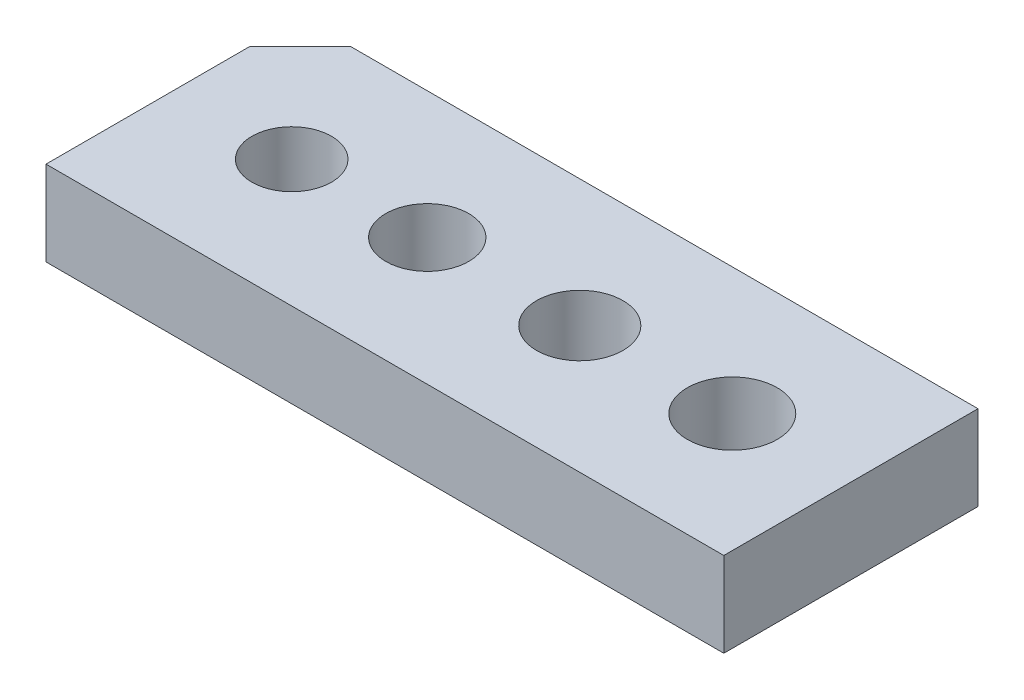
ISO-10303-21;
HEADER;
FILE_DESCRIPTION(('STEP AP214'),'2;1');
FILE_NAME('part.step','',(''),(''),'','','');
FILE_SCHEMA(('AUTOMOTIVE_DESIGN { 1 0 10303 214 1 1 1 1 }'));
ENDSEC;
DATA;
#1=APPLICATION_CONTEXT('core data for automotive mechanical design processes');
#2=APPLICATION_PROTOCOL_DEFINITION('international standard','automotive_design',2000,#1);
#3=PRODUCT_CONTEXT('',#1,'mechanical');
#4=PRODUCT('Part','Part','',(#3));
#5=PRODUCT_RELATED_PRODUCT_CATEGORY('part','',(#4));
#6=PRODUCT_DEFINITION_FORMATION('','',#4);
#7=PRODUCT_DEFINITION_CONTEXT('part definition',#1,'design');
#8=PRODUCT_DEFINITION('design','',#6,#7);
#9=PRODUCT_DEFINITION_SHAPE('','',#8);
#10=(LENGTH_UNIT() NAMED_UNIT(*) SI_UNIT(.MILLI.,.METRE.));
#11=(NAMED_UNIT(*) PLANE_ANGLE_UNIT() SI_UNIT($,.RADIAN.));
#12=(NAMED_UNIT(*) SI_UNIT($,.STERADIAN.) SOLID_ANGLE_UNIT());
#13=UNCERTAINTY_MEASURE_WITH_UNIT(LENGTH_MEASURE(1.E-05),#10,'distance_accuracy_value','');
#14=(GEOMETRIC_REPRESENTATION_CONTEXT(3) GLOBAL_UNCERTAINTY_ASSIGNED_CONTEXT((#13)) GLOBAL_UNIT_ASSIGNED_CONTEXT((#10,
#11,#12)) REPRESENTATION_CONTEXT('',''));
#15=CARTESIAN_POINT('',(0.,0.,0.));
#16=DIRECTION('',(0.,0.,1.));
#17=DIRECTION('',(1.,0.,0.));
#18=AXIS2_PLACEMENT_3D('',#15,#16,#17);
#19=CARTESIAN_POINT('',(0.,5.,0.));
#20=DIRECTION('',(0.,1.,0.));
#21=DIRECTION('',(0.,0.,1.));
#22=AXIS2_PLACEMENT_3D('',#19,#20,#21);
#23=PLANE('',#22);
#24=CARTESIAN_POINT('',(4.,5.,0.));
#25=DIRECTION('',(0.,1.,0.));
#26=DIRECTION('',(0.,0.,1.));
#27=AXIS2_PLACEMENT_3D('',#24,#25,#26);
#28=CIRCLE('',#27,2.55);
#29=CARTESIAN_POINT('',(4.,5.,2.55));
#30=VERTEX_POINT('',#29);
#31=EDGE_CURVE('E172',#30,#30,#28,.T.);
#32=ORIENTED_EDGE('',*,*,#31,.F.);
#33=EDGE_LOOP('',(#32));
#34=FACE_BOUND('',#33,.T.);
#35=CARTESIAN_POINT('',(-13.,5.,0.));
#36=DIRECTION('',(0.,1.,0.));
#37=DIRECTION('',(0.,0.,1.));
#38=AXIS2_PLACEMENT_3D('',#35,#36,#37);
#39=CIRCLE('',#38,2.35);
#40=CARTESIAN_POINT('',(-13.,5.,2.35));
#41=VERTEX_POINT('',#40);
#42=EDGE_CURVE('E112',#41,#41,#39,.T.);
#43=ORIENTED_EDGE('',*,*,#42,.F.);
#44=EDGE_LOOP('',(#43));
#45=FACE_BOUND('',#44,.T.);
#46=DIRECTION('',(0.,0.,-1.));
#47=VECTOR('',#46,1.);
#48=CARTESIAN_POINT('',(20.,5.,-7.5));
#49=LINE('',#48,#47);
#50=CARTESIAN_POINT('',(20.,5.,7.5));
#51=VERTEX_POINT('',#50);
#52=CARTESIAN_POINT('',(20.,5.,-7.5));
#53=VERTEX_POINT('',#52);
#54=EDGE_CURVE('E117',#51,#53,#49,.T.);
#55=ORIENTED_EDGE('',*,*,#54,.T.);
#56=DIRECTION('',(-1.,0.,0.));
#57=VECTOR('',#56,1.);
#58=CARTESIAN_POINT('',(-17.,5.,-7.5));
#59=LINE('',#58,#57);
#60=CARTESIAN_POINT('',(-17.,5.,-7.5));
#61=VERTEX_POINT('',#60);
#62=EDGE_CURVE('E84',#53,#61,#59,.T.);
#63=ORIENTED_EDGE('',*,*,#62,.T.);
#64=DIRECTION('',(-0.707106781186547,0.,0.707106781186548));
#65=VECTOR('',#64,1.);
#66=CARTESIAN_POINT('',(-20.,5.,-4.49999999999999));
#67=LINE('',#66,#65);
#68=CARTESIAN_POINT('',(-20.,5.,-4.49999999999999));
#69=VERTEX_POINT('',#68);
#70=EDGE_CURVE('E88',#61,#69,#67,.T.);
#71=ORIENTED_EDGE('',*,*,#70,.T.);
#72=DIRECTION('',(0.,0.,1.));
#73=VECTOR('',#72,1.);
#74=CARTESIAN_POINT('',(-20.,5.,-4.49999999999999));
#75=LINE('',#74,#73);
#76=CARTESIAN_POINT('',(-20.,5.,7.5));
#77=VERTEX_POINT('',#76);
#78=EDGE_CURVE('E92',#69,#77,#75,.T.);
#79=ORIENTED_EDGE('',*,*,#78,.T.);
#80=DIRECTION('',(1.,0.,0.));
#81=VECTOR('',#80,1.);
#82=CARTESIAN_POINT('',(-20.,5.,7.5));
#83=LINE('',#82,#81);
#84=EDGE_CURVE('E50',#77,#51,#83,.T.);
#85=ORIENTED_EDGE('',*,*,#84,.T.);
#86=EDGE_LOOP('',(#55,#63,#71,#79,#85));
#87=FACE_BOUND('',#86,.T.);
#88=CARTESIAN_POINT('',(-5.,5.,0.));
#89=DIRECTION('',(0.,1.,0.));
#90=DIRECTION('',(0.,0.,1.));
#91=AXIS2_PLACEMENT_3D('',#88,#89,#90);
#92=CIRCLE('',#91,2.45);
#93=CARTESIAN_POINT('',(-5.,5.,2.45));
#94=VERTEX_POINT('',#93);
#95=EDGE_CURVE('E178',#94,#94,#92,.T.);
#96=ORIENTED_EDGE('',*,*,#95,.F.);
#97=EDGE_LOOP('',(#96));
#98=FACE_BOUND('',#97,.T.);
#99=CARTESIAN_POINT('',(13.,5.,0.));
#100=DIRECTION('',(0.,1.,0.));
#101=DIRECTION('',(0.,0.,1.));
#102=AXIS2_PLACEMENT_3D('',#99,#100,#101);
#103=CIRCLE('',#102,2.65);
#104=CARTESIAN_POINT('',(13.,5.,2.65));
#105=VERTEX_POINT('',#104);
#106=EDGE_CURVE('E163',#105,#105,#103,.T.);
#107=ORIENTED_EDGE('',*,*,#106,.F.);
#108=EDGE_LOOP('',(#107));
#109=FACE_BOUND('',#108,.T.);
#110=ADVANCED_FACE('F33',(#34,#45,#87,#98,#109),#23,.T.);
#111=CARTESIAN_POINT('',(0.,0.,0.));
#112=DIRECTION('',(0.,1.,0.));
#113=DIRECTION('',(0.,0.,1.));
#114=AXIS2_PLACEMENT_3D('',#111,#112,#113);
#115=PLANE('',#114);
#116=DIRECTION('',(0.,0.,-1.));
#117=VECTOR('',#116,1.);
#118=CARTESIAN_POINT('',(20.,0.,-7.5));
#119=LINE('',#118,#117);
#120=CARTESIAN_POINT('',(20.,0.,7.5));
#121=VERTEX_POINT('',#120);
#122=CARTESIAN_POINT('',(20.,0.,-7.5));
#123=VERTEX_POINT('',#122);
#124=EDGE_CURVE('E108',#121,#123,#119,.T.);
#125=ORIENTED_EDGE('',*,*,#124,.F.);
#126=DIRECTION('',(1.,0.,0.));
#127=VECTOR('',#126,1.);
#128=CARTESIAN_POINT('',(-20.,0.,7.5));
#129=LINE('',#128,#127);
#130=CARTESIAN_POINT('',(-20.,0.,7.5));
#131=VERTEX_POINT('',#130);
#132=EDGE_CURVE('E76',#131,#121,#129,.T.);
#133=ORIENTED_EDGE('',*,*,#132,.F.);
#134=DIRECTION('',(0.,0.,1.));
#135=VECTOR('',#134,1.);
#136=CARTESIAN_POINT('',(-20.,0.,-4.49999999999999));
#137=LINE('',#136,#135);
#138=CARTESIAN_POINT('',(-20.,0.,-4.49999999999999));
#139=VERTEX_POINT('',#138);
#140=EDGE_CURVE('E70',#139,#131,#137,.T.);
#141=ORIENTED_EDGE('',*,*,#140,.F.);
#142=DIRECTION('',(-0.707106781186547,0.,0.707106781186548));
#143=VECTOR('',#142,1.);
#144=CARTESIAN_POINT('',(-20.,0.,-4.49999999999999));
#145=LINE('',#144,#143);
#146=CARTESIAN_POINT('',(-17.,0.,-7.5));
#147=VERTEX_POINT('',#146);
#148=EDGE_CURVE('E99',#147,#139,#145,.T.);
#149=ORIENTED_EDGE('',*,*,#148,.F.);
#150=DIRECTION('',(-1.,0.,0.));
#151=VECTOR('',#150,1.);
#152=CARTESIAN_POINT('',(-17.,0.,-7.5));
#153=LINE('',#152,#151);
#154=EDGE_CURVE('E111',#123,#147,#153,.T.);
#155=ORIENTED_EDGE('',*,*,#154,.F.);
#156=EDGE_LOOP('',(#125,#133,#141,#149,#155));
#157=FACE_BOUND('',#156,.T.);
#158=CARTESIAN_POINT('',(-13.,0.,0.));
#159=DIRECTION('',(0.,1.,0.));
#160=DIRECTION('',(0.,0.,1.));
#161=AXIS2_PLACEMENT_3D('',#158,#159,#160);
#162=CIRCLE('',#161,2.35);
#163=CARTESIAN_POINT('',(-13.,0.,2.35));
#164=VERTEX_POINT('',#163);
#165=EDGE_CURVE('E181',#164,#164,#162,.T.);
#166=ORIENTED_EDGE('',*,*,#165,.T.);
#167=EDGE_LOOP('',(#166));
#168=FACE_BOUND('',#167,.T.);
#169=CARTESIAN_POINT('',(-5.,0.,0.));
#170=DIRECTION('',(0.,1.,0.));
#171=DIRECTION('',(0.,0.,1.));
#172=AXIS2_PLACEMENT_3D('',#169,#170,#171);
#173=CIRCLE('',#172,2.45);
#174=CARTESIAN_POINT('',(-5.,0.,2.45));
#175=VERTEX_POINT('',#174);
#176=EDGE_CURVE('E175',#175,#175,#173,.T.);
#177=ORIENTED_EDGE('',*,*,#176,.T.);
#178=EDGE_LOOP('',(#177));
#179=FACE_BOUND('',#178,.T.);
#180=CARTESIAN_POINT('',(4.,0.,0.));
#181=DIRECTION('',(0.,1.,0.));
#182=DIRECTION('',(0.,0.,1.));
#183=AXIS2_PLACEMENT_3D('',#180,#181,#182);
#184=CIRCLE('',#183,2.55);
#185=CARTESIAN_POINT('',(4.,0.,2.55));
#186=VERTEX_POINT('',#185);
#187=EDGE_CURVE('E169',#186,#186,#184,.T.);
#188=ORIENTED_EDGE('',*,*,#187,.T.);
#189=EDGE_LOOP('',(#188));
#190=FACE_BOUND('',#189,.T.);
#191=CARTESIAN_POINT('',(13.,0.,0.));
#192=DIRECTION('',(0.,1.,0.));
#193=DIRECTION('',(0.,0.,1.));
#194=AXIS2_PLACEMENT_3D('',#191,#192,#193);
#195=CIRCLE('',#194,2.65);
#196=CARTESIAN_POINT('',(13.,0.,2.65));
#197=VERTEX_POINT('',#196);
#198=EDGE_CURVE('E166',#197,#197,#195,.T.);
#199=ORIENTED_EDGE('',*,*,#198,.T.);
#200=EDGE_LOOP('',(#199));
#201=FACE_BOUND('',#200,.T.);
#202=ADVANCED_FACE('F121',(#157,#168,#179,#190,#201),#115,.F.);
#203=CARTESIAN_POINT('',(20.,5.,-7.5));
#204=DIRECTION('',(-1.,0.,0.));
#205=DIRECTION('',(0.,0.,1.));
#206=AXIS2_PLACEMENT_3D('',#203,#204,#205);
#207=PLANE('',#206);
#208=ORIENTED_EDGE('',*,*,#124,.T.);
#209=DIRECTION('',(0.,-1.,0.));
#210=VECTOR('',#209,1.);
#211=CARTESIAN_POINT('',(20.,5.,-7.5));
#212=LINE('',#211,#210);
#213=EDGE_CURVE('E11',#53,#123,#212,.T.);
#214=ORIENTED_EDGE('',*,*,#213,.F.);
#215=ORIENTED_EDGE('',*,*,#54,.F.);
#216=DIRECTION('',(0.,-1.,0.));
#217=VECTOR('',#216,1.);
#218=CARTESIAN_POINT('',(20.,5.,7.5));
#219=LINE('',#218,#217);
#220=EDGE_CURVE('E104',#51,#121,#219,.T.);
#221=ORIENTED_EDGE('',*,*,#220,.T.);
#222=EDGE_LOOP('',(#208,#214,#215,#221));
#223=FACE_BOUND('',#222,.T.);
#224=ADVANCED_FACE('F35',(#223),#207,.F.);
#225=CARTESIAN_POINT('',(-17.,5.,-7.5));
#226=DIRECTION('',(0.,0.,1.));
#227=DIRECTION('',(1.,0.,0.));
#228=AXIS2_PLACEMENT_3D('',#225,#226,#227);
#229=PLANE('',#228);
#230=ORIENTED_EDGE('',*,*,#154,.T.);
#231=DIRECTION('',(0.,-1.,0.));
#232=VECTOR('',#231,1.);
#233=CARTESIAN_POINT('',(-17.,5.,-7.5));
#234=LINE('',#233,#232);
#235=EDGE_CURVE('E42',#61,#147,#234,.T.);
#236=ORIENTED_EDGE('',*,*,#235,.F.);
#237=ORIENTED_EDGE('',*,*,#62,.F.);
#238=ORIENTED_EDGE('',*,*,#213,.T.);
#239=EDGE_LOOP('',(#230,#236,#237,#238));
#240=FACE_BOUND('',#239,.T.);
#241=ADVANCED_FACE('F230',(#240),#229,.F.);
#242=CARTESIAN_POINT('',(-20.,5.,-4.49999999999999));
#243=DIRECTION('',(0.707106781186548,0.,0.707106781186547));
#244=DIRECTION('',(0.707106781186547,0.,-0.707106781186548));
#245=AXIS2_PLACEMENT_3D('',#242,#243,#244);
#246=PLANE('',#245);
#247=ORIENTED_EDGE('',*,*,#148,.T.);
#248=DIRECTION('',(0.,-1.,0.));
#249=VECTOR('',#248,1.);
#250=CARTESIAN_POINT('',(-20.,5.,-4.49999999999999));
#251=LINE('',#250,#249);
#252=EDGE_CURVE('E96',#69,#139,#251,.T.);
#253=ORIENTED_EDGE('',*,*,#252,.F.);
#254=ORIENTED_EDGE('',*,*,#70,.F.);
#255=ORIENTED_EDGE('',*,*,#235,.T.);
#256=EDGE_LOOP('',(#247,#253,#254,#255));
#257=FACE_BOUND('',#256,.T.);
#258=ADVANCED_FACE('F97',(#257),#246,.F.);
#259=CARTESIAN_POINT('',(-20.,5.,-4.49999999999999));
#260=DIRECTION('',(1.,0.,0.));
#261=DIRECTION('',(0.,0.,-1.));
#262=AXIS2_PLACEMENT_3D('',#259,#260,#261);
#263=PLANE('',#262);
#264=ORIENTED_EDGE('',*,*,#140,.T.);
#265=DIRECTION('',(0.,-1.,0.));
#266=VECTOR('',#265,1.);
#267=CARTESIAN_POINT('',(-20.,5.,7.5));
#268=LINE('',#267,#266);
#269=EDGE_CURVE('E100',#77,#131,#268,.T.);
#270=ORIENTED_EDGE('',*,*,#269,.F.);
#271=ORIENTED_EDGE('',*,*,#78,.F.);
#272=ORIENTED_EDGE('',*,*,#252,.T.);
#273=EDGE_LOOP('',(#264,#270,#271,#272));
#274=FACE_BOUND('',#273,.T.);
#275=ADVANCED_FACE('F102',(#274),#263,.F.);
#276=CARTESIAN_POINT('',(-20.,5.,7.5));
#277=DIRECTION('',(0.,0.,-1.));
#278=DIRECTION('',(-1.,0.,0.));
#279=AXIS2_PLACEMENT_3D('',#276,#277,#278);
#280=PLANE('',#279);
#281=ORIENTED_EDGE('',*,*,#132,.T.);
#282=ORIENTED_EDGE('',*,*,#220,.F.);
#283=ORIENTED_EDGE('',*,*,#84,.F.);
#284=ORIENTED_EDGE('',*,*,#269,.T.);
#285=EDGE_LOOP('',(#281,#282,#283,#284));
#286=FACE_BOUND('',#285,.T.);
#287=ADVANCED_FACE('F126',(#286),#280,.F.);
#288=CARTESIAN_POINT('',(-13.,5.,0.));
#289=DIRECTION('',(0.,-1.,0.));
#290=DIRECTION('',(0.,0.,-1.));
#291=AXIS2_PLACEMENT_3D('',#288,#289,#290);
#292=CYLINDRICAL_SURFACE('',#291,2.35);
#293=ORIENTED_EDGE('',*,*,#42,.T.);
#294=EDGE_LOOP('',(#293));
#295=FACE_BOUND('',#294,.T.);
#296=ORIENTED_EDGE('',*,*,#165,.F.);
#297=EDGE_LOOP('',(#296));
#298=FACE_BOUND('',#297,.T.);
#299=ADVANCED_FACE('F128',(#295,#298),#292,.F.);
#300=CARTESIAN_POINT('',(-5.,5.,0.));
#301=DIRECTION('',(0.,-1.,0.));
#302=DIRECTION('',(0.,0.,-1.));
#303=AXIS2_PLACEMENT_3D('',#300,#301,#302);
#304=CYLINDRICAL_SURFACE('',#303,2.45);
#305=ORIENTED_EDGE('',*,*,#95,.T.);
#306=EDGE_LOOP('',(#305));
#307=FACE_BOUND('',#306,.T.);
#308=ORIENTED_EDGE('',*,*,#176,.F.);
#309=EDGE_LOOP('',(#308));
#310=FACE_BOUND('',#309,.T.);
#311=ADVANCED_FACE('F134',(#307,#310),#304,.F.);
#312=CARTESIAN_POINT('',(4.,5.,0.));
#313=DIRECTION('',(0.,-1.,0.));
#314=DIRECTION('',(0.,0.,-1.));
#315=AXIS2_PLACEMENT_3D('',#312,#313,#314);
#316=CYLINDRICAL_SURFACE('',#315,2.55);
#317=ORIENTED_EDGE('',*,*,#31,.T.);
#318=EDGE_LOOP('',(#317));
#319=FACE_BOUND('',#318,.T.);
#320=ORIENTED_EDGE('',*,*,#187,.F.);
#321=EDGE_LOOP('',(#320));
#322=FACE_BOUND('',#321,.T.);
#323=ADVANCED_FACE('F150',(#319,#322),#316,.F.);
#324=CARTESIAN_POINT('',(13.,5.,0.));
#325=DIRECTION('',(0.,-1.,0.));
#326=DIRECTION('',(0.,0.,-1.));
#327=AXIS2_PLACEMENT_3D('',#324,#325,#326);
#328=CYLINDRICAL_SURFACE('',#327,2.65);
#329=ORIENTED_EDGE('',*,*,#106,.T.);
#330=EDGE_LOOP('',(#329));
#331=FACE_BOUND('',#330,.T.);
#332=ORIENTED_EDGE('',*,*,#198,.F.);
#333=EDGE_LOOP('',(#332));
#334=FACE_BOUND('',#333,.T.);
#335=ADVANCED_FACE('F154',(#331,#334),#328,.F.);
#336=CLOSED_SHELL('',(#110,#202,#224,#241,#258,#275,#287,#299,#311,#323,#335));
#337=MANIFOLD_SOLID_BREP('B2',#336);
#338=ADVANCED_BREP_SHAPE_REPRESENTATION('',(#18,#337),#14);
#339=SHAPE_DEFINITION_REPRESENTATION(#9,#338);
ENDSEC;
END-ISO-10303-21;
